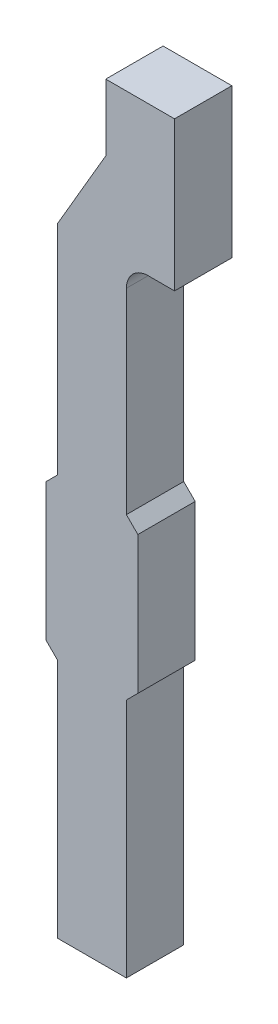
ISO-10303-21;
HEADER;
FILE_DESCRIPTION(('STEP AP214'),'2;1');
FILE_NAME('part.step','',(''),(''),'','','');
FILE_SCHEMA(('AUTOMOTIVE_DESIGN { 1 0 10303 214 1 1 1 1 }'));
ENDSEC;
DATA;
#1=APPLICATION_CONTEXT('core data for automotive mechanical design processes');
#2=APPLICATION_PROTOCOL_DEFINITION('international standard','automotive_design',2000,#1);
#3=PRODUCT_CONTEXT('',#1,'mechanical');
#4=PRODUCT('Part','Part','',(#3));
#5=PRODUCT_RELATED_PRODUCT_CATEGORY('part','',(#4));
#6=PRODUCT_DEFINITION_FORMATION('','',#4);
#7=PRODUCT_DEFINITION_CONTEXT('part definition',#1,'design');
#8=PRODUCT_DEFINITION('design','',#6,#7);
#9=PRODUCT_DEFINITION_SHAPE('','',#8);
#10=(LENGTH_UNIT() NAMED_UNIT(*) SI_UNIT(.MILLI.,.METRE.));
#11=(NAMED_UNIT(*) PLANE_ANGLE_UNIT() SI_UNIT($,.RADIAN.));
#12=(NAMED_UNIT(*) SI_UNIT($,.STERADIAN.) SOLID_ANGLE_UNIT());
#13=UNCERTAINTY_MEASURE_WITH_UNIT(LENGTH_MEASURE(1.E-05),#10,'distance_accuracy_value','');
#14=(GEOMETRIC_REPRESENTATION_CONTEXT(3) GLOBAL_UNCERTAINTY_ASSIGNED_CONTEXT((#13)) GLOBAL_UNIT_ASSIGNED_CONTEXT((#10,
#11,#12)) REPRESENTATION_CONTEXT('',''));
#15=CARTESIAN_POINT('',(0.,0.,0.));
#16=DIRECTION('',(0.,0.,1.));
#17=DIRECTION('',(1.,0.,0.));
#18=AXIS2_PLACEMENT_3D('',#15,#16,#17);
#19=CARTESIAN_POINT('',(-0.947681835087,-0.720595410161,0.));
#20=DIRECTION('',(0.,0.,1.));
#21=DIRECTION('',(1.,0.,0.));
#22=AXIS2_PLACEMENT_3D('',#19,#20,#21);
#23=PLANE('',#22);
#24=CARTESIAN_POINT('',(-0.78,-1.48999999,0.));
#25=DIRECTION('',(0.,0.,-1.));
#26=DIRECTION('',(-1.,0.,0.));
#27=AXIS2_PLACEMENT_3D('',#24,#25,#26);
#28=CIRCLE('',#27,0.19);
#29=CARTESIAN_POINT('',(-0.78,-1.29999999,0.));
#30=VERTEX_POINT('',#29);
#31=CARTESIAN_POINT('',(-0.97,-1.48999999,0.));
#32=VERTEX_POINT('',#31);
#33=EDGE_CURVE('E20',#30,#32,#28,.F.);
#34=ORIENTED_EDGE('',*,*,#33,.T.);
#35=DIRECTION('',(0.,1.,0.));
#36=VECTOR('',#35,1.);
#37=CARTESIAN_POINT('',(-0.97,-2.24999999,0.));
#38=LINE('',#37,#36);
#39=CARTESIAN_POINT('',(-0.970000001666667,-3.19999999333333,0.));
#40=VERTEX_POINT('',#39);
#41=EDGE_CURVE('E138',#40,#32,#38,.T.);
#42=ORIENTED_EDGE('',*,*,#41,.F.);
#43=DIRECTION('',(-0.70710674583121,0.707106816541884,0.));
#44=VECTOR('',#43,1.);
#45=CARTESIAN_POINT('',(-0.869999997339,-3.300000002661,0.));
#46=LINE('',#45,#44);
#47=CARTESIAN_POINT('',(-0.869999997339,-3.300000002661,0.));
#48=VERTEX_POINT('',#47);
#49=EDGE_CURVE('E149',#48,#40,#46,.T.);
#50=ORIENTED_EDGE('',*,*,#49,.F.);
#51=DIRECTION('',(0.,1.,0.));
#52=VECTOR('',#51,1.);
#53=CARTESIAN_POINT('',(-0.869999997339,-0.720595410161,0.));
#54=LINE('',#53,#52);
#55=CARTESIAN_POINT('',(-0.869999997339,-4.500000002661,0.));
#56=VERTEX_POINT('',#55);
#57=EDGE_CURVE('E191',#56,#48,#54,.T.);
#58=ORIENTED_EDGE('',*,*,#57,.F.);
#59=DIRECTION('',(0.707106781190085,0.70710678118301,0.));
#60=VECTOR('',#59,1.);
#61=CARTESIAN_POINT('',(-0.970000001774,-4.600000007095,0.));
#62=LINE('',#61,#60);
#63=CARTESIAN_POINT('',(-0.9700000022175,-4.6000000075385,0.));
#64=VERTEX_POINT('',#63);
#65=EDGE_CURVE('E199',#64,#56,#62,.T.);
#66=ORIENTED_EDGE('',*,*,#65,.F.);
#67=DIRECTION('',(0.,1.,0.));
#68=VECTOR('',#67,1.);
#69=CARTESIAN_POINT('',(-0.970000002661,-5.650000002661,0.));
#70=LINE('',#69,#68);
#71=CARTESIAN_POINT('',(-0.970000002661,-6.700000002661,0.));
#72=VERTEX_POINT('',#71);
#73=EDGE_CURVE('E210',#72,#64,#70,.T.);
#74=ORIENTED_EDGE('',*,*,#73,.F.);
#75=DIRECTION('',(1.,0.,0.));
#76=VECTOR('',#75,1.);
#77=CARTESIAN_POINT('',(-1.270000002661,-6.700000002661,0.));
#78=LINE('',#77,#76);
#79=CARTESIAN_POINT('',(-1.570000001774,-6.700000002661,0.));
#80=VERTEX_POINT('',#79);
#81=EDGE_CURVE('E235',#80,#72,#78,.T.);
#82=ORIENTED_EDGE('',*,*,#81,.F.);
#83=DIRECTION('',(0.,1.,0.));
#84=VECTOR('',#83,1.);
#85=CARTESIAN_POINT('',(-1.570000002661,-5.650000002661,0.));
#86=LINE('',#85,#84);
#87=CARTESIAN_POINT('',(-1.57000000121962,-4.60000000509938,0.));
#88=VERTEX_POINT('',#87);
#89=EDGE_CURVE('E241',#88,#80,#86,.F.);
#90=ORIENTED_EDGE('',*,*,#89,.F.);
#91=DIRECTION('',(0.707106781186548,-0.707106781186548,0.));
#92=VECTOR('',#91,1.);
#93=CARTESIAN_POINT('',(-1.62000000133,-4.550000003991,0.));
#94=LINE('',#93,#92);
#95=CARTESIAN_POINT('',(-1.67000000266088,-4.50000000266088,0.));
#96=VERTEX_POINT('',#95);
#97=EDGE_CURVE('E247',#96,#88,#94,.T.);
#98=ORIENTED_EDGE('',*,*,#97,.F.);
#99=DIRECTION('',(0.,1.,0.));
#100=VECTOR('',#99,1.);
#101=CARTESIAN_POINT('',(-1.670000002661,-3.900000002661,0.));
#102=LINE('',#101,#100);
#103=CARTESIAN_POINT('',(-1.670000002661,-3.300000002661,0.));
#104=VERTEX_POINT('',#103);
#105=EDGE_CURVE('E253',#104,#96,#102,.F.);
#106=ORIENTED_EDGE('',*,*,#105,.F.);
#107=DIRECTION('',(-0.707106781186548,-0.707106781186548,0.));
#108=VECTOR('',#107,1.);
#109=CARTESIAN_POINT('',(-1.62000000133,-3.25000000133,0.));
#110=LINE('',#109,#108);
#111=CARTESIAN_POINT('',(-1.56999999895837,-3.19999999354212,0.));
#112=VERTEX_POINT('',#111);
#113=EDGE_CURVE('E259',#112,#104,#110,.T.);
#114=ORIENTED_EDGE('',*,*,#113,.F.);
#115=DIRECTION('',(0.,1.,0.));
#116=VECTOR('',#115,1.);
#117=CARTESIAN_POINT('',(-1.57,-2.24999999,0.));
#118=LINE('',#117,#116);
#119=CARTESIAN_POINT('',(-1.56999999999993,-1.29999999000004,0.));
#120=VERTEX_POINT('',#119);
#121=EDGE_CURVE('E265',#120,#112,#118,.F.);
#122=ORIENTED_EDGE('',*,*,#121,.F.);
#123=DIRECTION('',(-0.503871023927029,-0.86377890183005,0.));
#124=VECTOR('',#123,1.);
#125=CARTESIAN_POINT('',(-1.360000003025,-0.939999993657,0.));
#126=LINE('',#125,#124);
#127=CARTESIAN_POINT('',(-1.15000000138472,-0.579999990179683,0.));
#128=VERTEX_POINT('',#127);
#129=EDGE_CURVE('E271',#128,#120,#126,.T.);
#130=ORIENTED_EDGE('',*,*,#129,.F.);
#131=DIRECTION('',(0.,1.,0.));
#132=VECTOR('',#131,1.);
#133=CARTESIAN_POINT('',(-1.15,-0.289999998657,0.));
#134=LINE('',#133,#132);
#135=CARTESIAN_POINT('',(-1.15,0.,0.));
#136=VERTEX_POINT('',#135);
#137=EDGE_CURVE('E187',#136,#128,#134,.F.);
#138=ORIENTED_EDGE('',*,*,#137,.F.);
#139=DIRECTION('',(-1.,0.,0.));
#140=VECTOR('',#139,1.);
#141=CARTESIAN_POINT('',(-0.85,0.,0.));
#142=LINE('',#141,#140);
#143=CARTESIAN_POINT('',(-0.55,0.,0.));
#144=VERTEX_POINT('',#143);
#145=EDGE_CURVE('E179',#144,#136,#142,.T.);
#146=ORIENTED_EDGE('',*,*,#145,.F.);
#147=DIRECTION('',(0.,1.,0.));
#148=VECTOR('',#147,1.);
#149=CARTESIAN_POINT('',(-0.55,-0.649999995,0.));
#150=LINE('',#149,#148);
#151=CARTESIAN_POINT('',(-0.55,-1.29999999,0.));
#152=VERTEX_POINT('',#151);
#153=EDGE_CURVE('E171',#152,#144,#150,.T.);
#154=ORIENTED_EDGE('',*,*,#153,.F.);
#155=DIRECTION('',(1.,0.,0.));
#156=VECTOR('',#155,1.);
#157=CARTESIAN_POINT('',(-1.06,-1.29999999,0.));
#158=LINE('',#157,#156);
#159=EDGE_CURVE('E141',#30,#152,#158,.T.);
#160=ORIENTED_EDGE('',*,*,#159,.F.);
#161=EDGE_LOOP('',(#34,#42,#50,#58,#66,#74,#82,#90,#98,#106,#114,#122,#130,#138,#146,#154,#160));
#162=FACE_BOUND('',#161,.T.);
#163=ADVANCED_FACE('F17',(#162),#23,.F.);
#164=CARTESIAN_POINT('',(-0.97,-2.24999999,0.));
#165=DIRECTION('',(1.,0.,0.));
#166=DIRECTION('',(0.,0.,-1.));
#167=AXIS2_PLACEMENT_3D('',#164,#165,#166);
#168=PLANE('',#167);
#169=DIRECTION('',(0.,0.,-1.));
#170=VECTOR('',#169,1.);
#171=CARTESIAN_POINT('',(-0.97,-1.48999999,0.));
#172=LINE('',#171,#170);
#173=CARTESIAN_POINT('',(-0.97,-1.48999999,0.5));
#174=VERTEX_POINT('',#173);
#175=EDGE_CURVE('E143',#32,#174,#172,.F.);
#176=ORIENTED_EDGE('',*,*,#175,.T.);
#177=DIRECTION('',(0.,1.,0.));
#178=VECTOR('',#177,1.);
#179=CARTESIAN_POINT('',(-0.97,-0.720595410161,0.5));
#180=LINE('',#179,#178);
#181=CARTESIAN_POINT('',(-0.970000001666667,-3.19999999166667,0.5));
#182=VERTEX_POINT('',#181);
#183=EDGE_CURVE('E195',#182,#174,#180,.T.);
#184=ORIENTED_EDGE('',*,*,#183,.F.);
#185=DIRECTION('',(0.,0.,1.));
#186=VECTOR('',#185,1.);
#187=CARTESIAN_POINT('',(-0.970000005,-3.199999995,0.));
#188=LINE('',#187,#186);
#189=EDGE_CURVE('E148',#40,#182,#188,.T.);
#190=ORIENTED_EDGE('',*,*,#189,.F.);
#191=ORIENTED_EDGE('',*,*,#41,.T.);
#192=EDGE_LOOP('',(#176,#184,#190,#191));
#193=FACE_BOUND('',#192,.T.);
#194=ADVANCED_FACE('F145',(#193),#168,.T.);
#195=CARTESIAN_POINT('',(-0.78,-1.48999999,0.));
#196=DIRECTION('',(0.,0.,-1.));
#197=DIRECTION('',(-1.,0.,0.));
#198=AXIS2_PLACEMENT_3D('',#195,#196,#197);
#199=CYLINDRICAL_SURFACE('',#198,0.19);
#200=ORIENTED_EDGE('',*,*,#33,.F.);
#201=DIRECTION('',(0.,0.,-1.));
#202=VECTOR('',#201,1.);
#203=CARTESIAN_POINT('',(-0.78,-1.29999999,0.));
#204=LINE('',#203,#202);
#205=CARTESIAN_POINT('',(-0.78,-1.29999999,0.5));
#206=VERTEX_POINT('',#205);
#207=EDGE_CURVE('E155',#206,#30,#204,.T.);
#208=ORIENTED_EDGE('',*,*,#207,.F.);
#209=CARTESIAN_POINT('',(-0.78,-1.48999999,0.5));
#210=DIRECTION('',(0.,0.,-1.));
#211=DIRECTION('',(-1.,0.,0.));
#212=AXIS2_PLACEMENT_3D('',#209,#210,#211);
#213=CIRCLE('',#212,0.19);
#214=EDGE_CURVE('E153',#174,#206,#213,.T.);
#215=ORIENTED_EDGE('',*,*,#214,.F.);
#216=ORIENTED_EDGE('',*,*,#175,.F.);
#217=EDGE_LOOP('',(#200,#208,#215,#216));
#218=FACE_BOUND('',#217,.T.);
#219=ADVANCED_FACE('F151',(#218),#199,.F.);
#220=CARTESIAN_POINT('',(-1.06,-1.29999999,0.));
#221=DIRECTION('',(0.,-1.,0.));
#222=DIRECTION('',(0.,0.,-1.));
#223=AXIS2_PLACEMENT_3D('',#220,#221,#222);
#224=PLANE('',#223);
#225=ORIENTED_EDGE('',*,*,#207,.T.);
#226=ORIENTED_EDGE('',*,*,#159,.T.);
#227=DIRECTION('',(0.,0.,-1.));
#228=VECTOR('',#227,1.);
#229=CARTESIAN_POINT('',(-0.55,-1.29999999,0.));
#230=LINE('',#229,#228);
#231=CARTESIAN_POINT('',(-0.55,-1.29999999,0.5));
#232=VERTEX_POINT('',#231);
#233=EDGE_CURVE('E176',#232,#152,#230,.T.);
#234=ORIENTED_EDGE('',*,*,#233,.F.);
#235=DIRECTION('',(1.,0.,0.));
#236=VECTOR('',#235,1.);
#237=CARTESIAN_POINT('',(-0.947681835087,-1.29999999,0.5));
#238=LINE('',#237,#236);
#239=EDGE_CURVE('E220',#206,#232,#238,.T.);
#240=ORIENTED_EDGE('',*,*,#239,.F.);
#241=EDGE_LOOP('',(#225,#226,#234,#240));
#242=FACE_BOUND('',#241,.T.);
#243=ADVANCED_FACE('F289',(#242),#224,.T.);
#244=CARTESIAN_POINT('',(-0.55,-0.649999995,0.));
#245=DIRECTION('',(1.,0.,0.));
#246=DIRECTION('',(0.,0.,-1.));
#247=AXIS2_PLACEMENT_3D('',#244,#245,#246);
#248=PLANE('',#247);
#249=DIRECTION('',(0.,1.,0.));
#250=VECTOR('',#249,1.);
#251=CARTESIAN_POINT('',(-0.55,-0.720595410161,0.5));
#252=LINE('',#251,#250);
#253=CARTESIAN_POINT('',(-0.55,0.,0.5));
#254=VERTEX_POINT('',#253);
#255=EDGE_CURVE('E223',#232,#254,#252,.T.);
#256=ORIENTED_EDGE('',*,*,#255,.F.);
#257=ORIENTED_EDGE('',*,*,#233,.T.);
#258=ORIENTED_EDGE('',*,*,#153,.T.);
#259=DIRECTION('',(0.,0.,1.));
#260=VECTOR('',#259,1.);
#261=CARTESIAN_POINT('',(-0.55,0.,0.));
#262=LINE('',#261,#260);
#263=EDGE_CURVE('E182',#254,#144,#262,.F.);
#264=ORIENTED_EDGE('',*,*,#263,.F.);
#265=EDGE_LOOP('',(#256,#257,#258,#264));
#266=FACE_BOUND('',#265,.T.);
#267=ADVANCED_FACE('F286',(#266),#248,.T.);
#268=CARTESIAN_POINT('',(-0.85,0.,0.));
#269=DIRECTION('',(0.,1.,0.));
#270=DIRECTION('',(-1.,0.,0.));
#271=AXIS2_PLACEMENT_3D('',#268,#269,#270);
#272=PLANE('',#271);
#273=DIRECTION('',(1.,0.,0.));
#274=VECTOR('',#273,1.);
#275=CARTESIAN_POINT('',(-0.947681835087,0.,0.5));
#276=LINE('',#275,#274);
#277=CARTESIAN_POINT('',(-1.15,0.,0.5));
#278=VERTEX_POINT('',#277);
#279=EDGE_CURVE('E281',#254,#278,#276,.F.);
#280=ORIENTED_EDGE('',*,*,#279,.F.);
#281=ORIENTED_EDGE('',*,*,#263,.T.);
#282=ORIENTED_EDGE('',*,*,#145,.T.);
#283=DIRECTION('',(0.,0.,1.));
#284=VECTOR('',#283,1.);
#285=CARTESIAN_POINT('',(-1.15,0.,0.));
#286=LINE('',#285,#284);
#287=EDGE_CURVE('E274',#278,#136,#286,.F.);
#288=ORIENTED_EDGE('',*,*,#287,.F.);
#289=EDGE_LOOP('',(#280,#281,#282,#288));
#290=FACE_BOUND('',#289,.T.);
#291=ADVANCED_FACE('F382',(#290),#272,.T.);
#292=CARTESIAN_POINT('',(-1.15,-0.289999998657,0.));
#293=DIRECTION('',(-1.,0.,0.));
#294=DIRECTION('',(0.,0.,1.));
#295=AXIS2_PLACEMENT_3D('',#292,#293,#294);
#296=PLANE('',#295);
#297=DIRECTION('',(0.,1.,0.));
#298=VECTOR('',#297,1.);
#299=CARTESIAN_POINT('',(-1.15,-0.720595410161,0.5));
#300=LINE('',#299,#298);
#301=CARTESIAN_POINT('',(-1.15000000138472,-0.579999991908684,0.5));
#302=VERTEX_POINT('',#301);
#303=EDGE_CURVE('E297',#278,#302,#300,.F.);
#304=ORIENTED_EDGE('',*,*,#303,.F.);
#305=ORIENTED_EDGE('',*,*,#287,.T.);
#306=ORIENTED_EDGE('',*,*,#137,.T.);
#307=DIRECTION('',(0.,0.,1.));
#308=VECTOR('',#307,1.);
#309=CARTESIAN_POINT('',(-1.15000000553886,-0.579999996437162,0.));
#310=LINE('',#309,#308);
#311=EDGE_CURVE('E268',#302,#128,#310,.F.);
#312=ORIENTED_EDGE('',*,*,#311,.F.);
#313=EDGE_LOOP('',(#304,#305,#306,#312));
#314=FACE_BOUND('',#313,.T.);
#315=ADVANCED_FACE('F378',(#314),#296,.T.);
#316=CARTESIAN_POINT('',(-1.360000003025,-0.939999993657,0.));
#317=DIRECTION('',(-0.86377890183005,0.503871023927029,0.));
#318=DIRECTION('',(-0.503871023927029,-0.86377890183005,0.));
#319=AXIS2_PLACEMENT_3D('',#316,#317,#318);
#320=PLANE('',#319);
#321=DIRECTION('',(-0.503871025732721,-0.86377890077673,0.));
#322=VECTOR('',#321,1.);
#323=CARTESIAN_POINT('',(-1.150000004034,-0.579999997315,0.5));
#324=LINE('',#323,#322);
#325=CARTESIAN_POINT('',(-1.56999999999987,-1.29999999000008,0.5));
#326=VERTEX_POINT('',#325);
#327=EDGE_CURVE('E300',#302,#326,#324,.T.);
#328=ORIENTED_EDGE('',*,*,#327,.F.);
#329=ORIENTED_EDGE('',*,*,#311,.T.);
#330=ORIENTED_EDGE('',*,*,#129,.T.);
#331=DIRECTION('',(0.,0.,1.));
#332=VECTOR('',#331,1.);
#333=CARTESIAN_POINT('',(-1.57,-1.29999999,0.));
#334=LINE('',#333,#332);
#335=EDGE_CURVE('E262',#326,#120,#334,.F.);
#336=ORIENTED_EDGE('',*,*,#335,.F.);
#337=EDGE_LOOP('',(#328,#329,#330,#336));
#338=FACE_BOUND('',#337,.T.);
#339=ADVANCED_FACE('F374',(#338),#320,.T.);
#340=CARTESIAN_POINT('',(-1.57,-2.24999999,0.));
#341=DIRECTION('',(-1.,0.,0.));
#342=DIRECTION('',(0.,0.,1.));
#343=AXIS2_PLACEMENT_3D('',#340,#341,#342);
#344=PLANE('',#343);
#345=DIRECTION('',(0.,1.,0.));
#346=VECTOR('',#345,1.);
#347=CARTESIAN_POINT('',(-1.57,-0.720595410161,0.5));
#348=LINE('',#347,#346);
#349=CARTESIAN_POINT('',(-1.56999999895838,-3.19999999437512,0.5));
#350=VERTEX_POINT('',#349);
#351=EDGE_CURVE('E304',#326,#350,#348,.F.);
#352=ORIENTED_EDGE('',*,*,#351,.F.);
#353=ORIENTED_EDGE('',*,*,#335,.T.);
#354=ORIENTED_EDGE('',*,*,#121,.T.);
#355=DIRECTION('',(0.,0.,1.));
#356=VECTOR('',#355,1.);
#357=CARTESIAN_POINT('',(-1.5699999958335,-3.1999999958335,0.));
#358=LINE('',#357,#356);
#359=EDGE_CURVE('E256',#350,#112,#358,.F.);
#360=ORIENTED_EDGE('',*,*,#359,.F.);
#361=EDGE_LOOP('',(#352,#353,#354,#360));
#362=FACE_BOUND('',#361,.T.);
#363=ADVANCED_FACE('F370',(#362),#344,.T.);
#364=CARTESIAN_POINT('',(-1.62000000133,-3.25000000133,0.));
#365=DIRECTION('',(-0.707106781186548,0.707106781186548,0.));
#366=DIRECTION('',(-0.707106781186548,-0.707106781186548,0.));
#367=AXIS2_PLACEMENT_3D('',#364,#365,#366);
#368=PLANE('',#367);
#369=DIRECTION('',(-0.707106775292815,-0.70710678708028,0.));
#370=VECTOR('',#369,1.);
#371=CARTESIAN_POINT('',(-1.569999996667,-3.199999995,0.5));
#372=LINE('',#371,#370);
#373=CARTESIAN_POINT('',(-1.670000002661,-3.300000002661,0.5));
#374=VERTEX_POINT('',#373);
#375=EDGE_CURVE('E307',#350,#374,#372,.T.);
#376=ORIENTED_EDGE('',*,*,#375,.F.);
#377=ORIENTED_EDGE('',*,*,#359,.T.);
#378=ORIENTED_EDGE('',*,*,#113,.T.);
#379=DIRECTION('',(0.,0.,1.));
#380=VECTOR('',#379,1.);
#381=CARTESIAN_POINT('',(-1.670000002661,-3.300000002661,0.));
#382=LINE('',#381,#380);
#383=EDGE_CURVE('E250',#374,#104,#382,.F.);
#384=ORIENTED_EDGE('',*,*,#383,.F.);
#385=EDGE_LOOP('',(#376,#377,#378,#384));
#386=FACE_BOUND('',#385,.T.);
#387=ADVANCED_FACE('F366',(#386),#368,.T.);
#388=CARTESIAN_POINT('',(-1.670000002661,-3.900000002661,0.));
#389=DIRECTION('',(-1.,0.,0.));
#390=DIRECTION('',(0.,0.,1.));
#391=AXIS2_PLACEMENT_3D('',#388,#389,#390);
#392=PLANE('',#391);
#393=DIRECTION('',(0.,1.,0.));
#394=VECTOR('',#393,1.);
#395=CARTESIAN_POINT('',(-1.670000002661,-0.720595410161,0.5));
#396=LINE('',#395,#394);
#397=CARTESIAN_POINT('',(-1.67000000266088,-4.50000000266088,0.5));
#398=VERTEX_POINT('',#397);
#399=EDGE_CURVE('E310',#374,#398,#396,.F.);
#400=ORIENTED_EDGE('',*,*,#399,.F.);
#401=ORIENTED_EDGE('',*,*,#383,.T.);
#402=ORIENTED_EDGE('',*,*,#105,.T.);
#403=DIRECTION('',(0.,0.,1.));
#404=VECTOR('',#403,1.);
#405=CARTESIAN_POINT('',(-1.6700000026605,-4.5000000026605,0.));
#406=LINE('',#405,#404);
#407=EDGE_CURVE('E244',#398,#96,#406,.F.);
#408=ORIENTED_EDGE('',*,*,#407,.F.);
#409=EDGE_LOOP('',(#400,#401,#402,#408));
#410=FACE_BOUND('',#409,.T.);
#411=ADVANCED_FACE('F362',(#410),#392,.T.);
#412=CARTESIAN_POINT('',(-1.62000000133,-4.550000003991,0.));
#413=DIRECTION('',(-0.707106781186548,-0.707106781186548,0.));
#414=DIRECTION('',(0.707106781186548,-0.707106781186548,0.));
#415=AXIS2_PLACEMENT_3D('',#412,#413,#414);
#416=PLANE('',#415);
#417=DIRECTION('',(0.707106774918049,-0.707106787455047,0.));
#418=VECTOR('',#417,1.);
#419=CARTESIAN_POINT('',(-1.670000002661,-4.500000002661,0.5));
#420=LINE('',#419,#418);
#421=CARTESIAN_POINT('',(-1.57000000144125,-4.60000000487775,0.5));
#422=VERTEX_POINT('',#421);
#423=EDGE_CURVE('E313',#398,#422,#420,.T.);
#424=ORIENTED_EDGE('',*,*,#423,.F.);
#425=ORIENTED_EDGE('',*,*,#407,.T.);
#426=ORIENTED_EDGE('',*,*,#97,.T.);
#427=DIRECTION('',(0.,0.,1.));
#428=VECTOR('',#427,1.);
#429=CARTESIAN_POINT('',(-1.570000002661,-4.600000004878,0.));
#430=LINE('',#429,#428);
#431=EDGE_CURVE('E238',#422,#88,#430,.F.);
#432=ORIENTED_EDGE('',*,*,#431,.F.);
#433=EDGE_LOOP('',(#424,#425,#426,#432));
#434=FACE_BOUND('',#433,.T.);
#435=ADVANCED_FACE('F358',(#434),#416,.T.);
#436=CARTESIAN_POINT('',(-1.570000002661,-5.650000002661,0.));
#437=DIRECTION('',(-1.,0.,0.));
#438=DIRECTION('',(0.,0.,1.));
#439=AXIS2_PLACEMENT_3D('',#436,#437,#438);
#440=PLANE('',#439);
#441=DIRECTION('',(0.,1.,0.));
#442=VECTOR('',#441,1.);
#443=CARTESIAN_POINT('',(-1.570000002217,-0.720595410161,0.5));
#444=LINE('',#443,#442);
#445=CARTESIAN_POINT('',(-1.57000000255,-6.700000002661,0.5));
#446=VERTEX_POINT('',#445);
#447=EDGE_CURVE('E316',#422,#446,#444,.F.);
#448=ORIENTED_EDGE('',*,*,#447,.F.);
#449=ORIENTED_EDGE('',*,*,#431,.T.);
#450=ORIENTED_EDGE('',*,*,#89,.T.);
#451=DIRECTION('',(0.,0.,-1.));
#452=VECTOR('',#451,1.);
#453=CARTESIAN_POINT('',(-1.570000002661,-6.700000002661,0.));
#454=LINE('',#453,#452);
#455=EDGE_CURVE('E214',#446,#80,#454,.T.);
#456=ORIENTED_EDGE('',*,*,#455,.F.);
#457=EDGE_LOOP('',(#448,#449,#450,#456));
#458=FACE_BOUND('',#457,.T.);
#459=ADVANCED_FACE('F354',(#458),#440,.T.);
#460=CARTESIAN_POINT('',(-1.270000002661,-6.700000002661,0.));
#461=DIRECTION('',(0.,-1.,0.));
#462=DIRECTION('',(0.,0.,-1.));
#463=AXIS2_PLACEMENT_3D('',#460,#461,#462);
#464=PLANE('',#463);
#465=DIRECTION('',(1.,0.,0.));
#466=VECTOR('',#465,1.);
#467=CARTESIAN_POINT('',(-0.947681835087,-6.700000002661,0.5));
#468=LINE('',#467,#466);
#469=CARTESIAN_POINT('',(-0.970000002661,-6.700000002661,0.5));
#470=VERTEX_POINT('',#469);
#471=EDGE_CURVE('E319',#446,#470,#468,.T.);
#472=ORIENTED_EDGE('',*,*,#471,.F.);
#473=ORIENTED_EDGE('',*,*,#455,.T.);
#474=ORIENTED_EDGE('',*,*,#81,.T.);
#475=DIRECTION('',(0.,0.,1.));
#476=VECTOR('',#475,1.);
#477=CARTESIAN_POINT('',(-0.970000002661,-6.700000002661,0.));
#478=LINE('',#477,#476);
#479=EDGE_CURVE('E213',#470,#72,#478,.F.);
#480=ORIENTED_EDGE('',*,*,#479,.F.);
#481=EDGE_LOOP('',(#472,#473,#474,#480));
#482=FACE_BOUND('',#481,.T.);
#483=ADVANCED_FACE('F350',(#482),#464,.T.);
#484=CARTESIAN_POINT('',(-0.970000002661,-5.650000002661,0.));
#485=DIRECTION('',(1.,0.,0.));
#486=DIRECTION('',(0.,1.,0.));
#487=AXIS2_PLACEMENT_3D('',#484,#485,#486);
#488=PLANE('',#487);
#489=DIRECTION('',(0.,1.,0.));
#490=VECTOR('',#489,1.);
#491=CARTESIAN_POINT('',(-0.970000002661,-0.720595410161,0.5));
#492=LINE('',#491,#490);
#493=CARTESIAN_POINT('',(-0.970000002328375,-4.60000000698412,0.5));
#494=VERTEX_POINT('',#493);
#495=EDGE_CURVE('E322',#470,#494,#492,.T.);
#496=ORIENTED_EDGE('',*,*,#495,.F.);
#497=ORIENTED_EDGE('',*,*,#479,.T.);
#498=ORIENTED_EDGE('',*,*,#73,.T.);
#499=DIRECTION('',(0.,0.,1.));
#500=VECTOR('',#499,1.);
#501=CARTESIAN_POINT('',(-0.9700000013305,-4.6000000066515,0.));
#502=LINE('',#501,#500);
#503=EDGE_CURVE('E204',#494,#64,#502,.F.);
#504=ORIENTED_EDGE('',*,*,#503,.F.);
#505=EDGE_LOOP('',(#496,#497,#498,#504));
#506=FACE_BOUND('',#505,.T.);
#507=ADVANCED_FACE('F347',(#506),#488,.T.);
#508=CARTESIAN_POINT('',(-0.91999999867,-4.550000003991,0.));
#509=DIRECTION('',(0.707106781186548,-0.707106781186548,0.));
#510=DIRECTION('',(0.707106781186548,0.707106781186548,0.));
#511=AXIS2_PLACEMENT_3D('',#508,#509,#510);
#512=PLANE('',#511);
#513=DIRECTION('',(0.707106784326103,0.707106778046993,0.));
#514=VECTOR('',#513,1.);
#515=CARTESIAN_POINT('',(-0.970000001774,-4.600000006208,0.5));
#516=LINE('',#515,#514);
#517=CARTESIAN_POINT('',(-0.86999999733925,-4.50000000266075,0.5));
#518=VERTEX_POINT('',#517);
#519=EDGE_CURVE('E325',#494,#518,#516,.T.);
#520=ORIENTED_EDGE('',*,*,#519,.F.);
#521=ORIENTED_EDGE('',*,*,#503,.T.);
#522=ORIENTED_EDGE('',*,*,#65,.T.);
#523=DIRECTION('',(0.,0.,1.));
#524=VECTOR('',#523,1.);
#525=CARTESIAN_POINT('',(-0.869999997338999,-4.500000002661,0.));
#526=LINE('',#525,#524);
#527=EDGE_CURVE('E163',#518,#56,#526,.F.);
#528=ORIENTED_EDGE('',*,*,#527,.F.);
#529=EDGE_LOOP('',(#520,#521,#522,#528));
#530=FACE_BOUND('',#529,.T.);
#531=ADVANCED_FACE('F342',(#530),#512,.T.);
#532=CARTESIAN_POINT('',(-0.869999997339,-3.900000002661,0.));
#533=DIRECTION('',(1.,0.,0.));
#534=DIRECTION('',(0.,1.,0.));
#535=AXIS2_PLACEMENT_3D('',#532,#533,#534);
#536=PLANE('',#535);
#537=DIRECTION('',(0.,1.,0.));
#538=VECTOR('',#537,1.);
#539=CARTESIAN_POINT('',(-0.869999997339,-0.720595410161,0.5));
#540=LINE('',#539,#538);
#541=CARTESIAN_POINT('',(-0.869999997339,-3.300000002661,0.5));
#542=VERTEX_POINT('',#541);
#543=EDGE_CURVE('E26',#518,#542,#540,.T.);
#544=ORIENTED_EDGE('',*,*,#543,.F.);
#545=ORIENTED_EDGE('',*,*,#527,.T.);
#546=ORIENTED_EDGE('',*,*,#57,.T.);
#547=DIRECTION('',(0.,0.,1.));
#548=VECTOR('',#547,1.);
#549=CARTESIAN_POINT('',(-0.869999997339,-3.300000002661,0.));
#550=LINE('',#549,#548);
#551=EDGE_CURVE('E35',#542,#48,#550,.F.);
#552=ORIENTED_EDGE('',*,*,#551,.F.);
#553=EDGE_LOOP('',(#544,#545,#546,#552));
#554=FACE_BOUND('',#553,.T.);
#555=ADVANCED_FACE('F329',(#554),#536,.T.);
#556=CARTESIAN_POINT('',(-0.91999999867,-3.25000000133,0.));
#557=DIRECTION('',(0.707106781186548,0.707106781186548,0.));
#558=DIRECTION('',(-0.707106781186548,0.707106781186548,0.));
#559=AXIS2_PLACEMENT_3D('',#556,#557,#558);
#560=PLANE('',#559);
#561=DIRECTION('',(-0.70710674583121,0.707106816541884,0.));
#562=VECTOR('',#561,1.);
#563=CARTESIAN_POINT('',(-0.869999997339,-3.300000002661,0.5));
#564=LINE('',#563,#562);
#565=EDGE_CURVE('E11',#542,#182,#564,.T.);
#566=ORIENTED_EDGE('',*,*,#565,.F.);
#567=ORIENTED_EDGE('',*,*,#551,.T.);
#568=ORIENTED_EDGE('',*,*,#49,.T.);
#569=ORIENTED_EDGE('',*,*,#189,.T.);
#570=EDGE_LOOP('',(#566,#567,#568,#569));
#571=FACE_BOUND('',#570,.T.);
#572=ADVANCED_FACE('F333',(#571),#560,.T.);
#573=CARTESIAN_POINT('',(-0.947681835087,-0.720595410161,0.5));
#574=DIRECTION('',(0.,0.,1.));
#575=DIRECTION('',(1.,0.,0.));
#576=AXIS2_PLACEMENT_3D('',#573,#574,#575);
#577=PLANE('',#576);
#578=ORIENTED_EDGE('',*,*,#543,.T.);
#579=ORIENTED_EDGE('',*,*,#565,.T.);
#580=ORIENTED_EDGE('',*,*,#183,.T.);
#581=ORIENTED_EDGE('',*,*,#214,.T.);
#582=ORIENTED_EDGE('',*,*,#239,.T.);
#583=ORIENTED_EDGE('',*,*,#255,.T.);
#584=ORIENTED_EDGE('',*,*,#279,.T.);
#585=ORIENTED_EDGE('',*,*,#303,.T.);
#586=ORIENTED_EDGE('',*,*,#327,.T.);
#587=ORIENTED_EDGE('',*,*,#351,.T.);
#588=ORIENTED_EDGE('',*,*,#375,.T.);
#589=ORIENTED_EDGE('',*,*,#399,.T.);
#590=ORIENTED_EDGE('',*,*,#423,.T.);
#591=ORIENTED_EDGE('',*,*,#447,.T.);
#592=ORIENTED_EDGE('',*,*,#471,.T.);
#593=ORIENTED_EDGE('',*,*,#495,.T.);
#594=ORIENTED_EDGE('',*,*,#519,.T.);
#595=EDGE_LOOP('',(#578,#579,#580,#581,#582,#583,#584,#585,#586,#587,#588,#589,#590,#591,#592,
#593,#594));
#596=FACE_BOUND('',#595,.T.);
#597=ADVANCED_FACE('F291',(#596),#577,.T.);
#598=CLOSED_SHELL('',(#163,#194,#219,#243,#267,#291,#315,#339,#363,#387,#411,#435,#459,#483,
#507,#531,#555,#572,#597));
#599=MANIFOLD_SOLID_BREP('B1',#598);
#600=ADVANCED_BREP_SHAPE_REPRESENTATION('',(#18,#599),#14);
#601=SHAPE_DEFINITION_REPRESENTATION(#9,#600);
ENDSEC;
END-ISO-10303-21;
